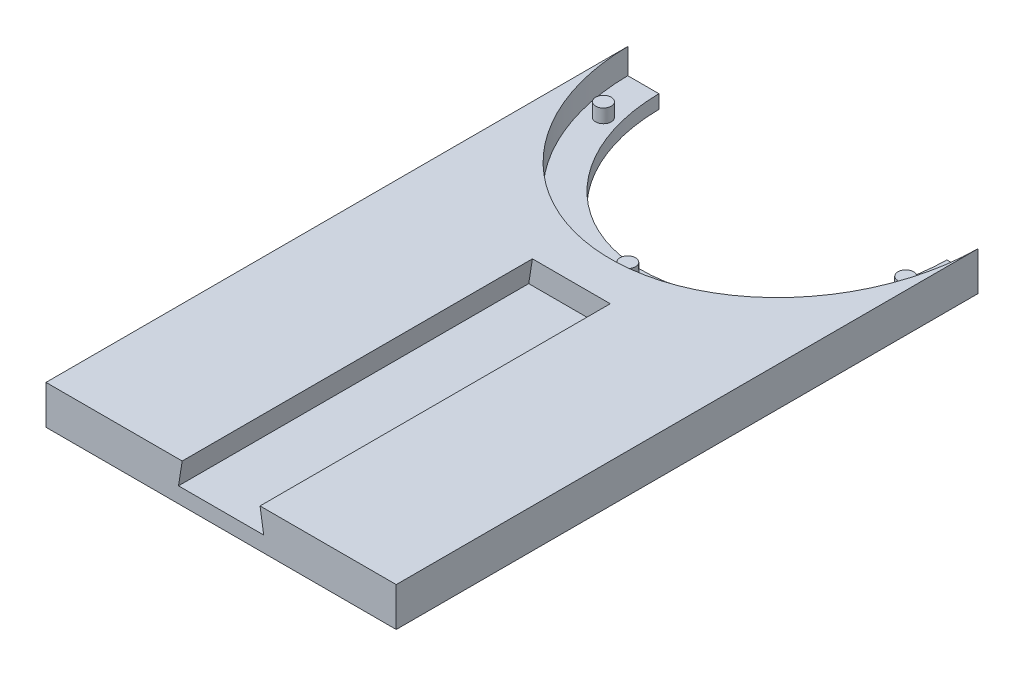
ISO-10303-21;
HEADER;
FILE_DESCRIPTION(('STEP AP214'),'2;1');
FILE_NAME('part.step','',(''),(''),'','','');
FILE_SCHEMA(('AUTOMOTIVE_DESIGN { 1 0 10303 214 1 1 1 1 }'));
ENDSEC;
DATA;
#1=APPLICATION_CONTEXT('core data for automotive mechanical design processes');
#2=APPLICATION_PROTOCOL_DEFINITION('international standard','automotive_design',2000,#1);
#3=PRODUCT_CONTEXT('',#1,'mechanical');
#4=PRODUCT('Part','Part','',(#3));
#5=PRODUCT_RELATED_PRODUCT_CATEGORY('part','',(#4));
#6=PRODUCT_DEFINITION_FORMATION('','',#4);
#7=PRODUCT_DEFINITION_CONTEXT('part definition',#1,'design');
#8=PRODUCT_DEFINITION('design','',#6,#7);
#9=PRODUCT_DEFINITION_SHAPE('','',#8);
#10=(LENGTH_UNIT() NAMED_UNIT(*) SI_UNIT(.MILLI.,.METRE.));
#11=(NAMED_UNIT(*) PLANE_ANGLE_UNIT() SI_UNIT($,.RADIAN.));
#12=(NAMED_UNIT(*) SI_UNIT($,.STERADIAN.) SOLID_ANGLE_UNIT());
#13=UNCERTAINTY_MEASURE_WITH_UNIT(LENGTH_MEASURE(1.E-05),#10,'distance_accuracy_value','');
#14=(GEOMETRIC_REPRESENTATION_CONTEXT(3) GLOBAL_UNCERTAINTY_ASSIGNED_CONTEXT((#13)) GLOBAL_UNIT_ASSIGNED_CONTEXT((#10,
#11,#12)) REPRESENTATION_CONTEXT('',''));
#15=CARTESIAN_POINT('',(0.,0.,0.));
#16=DIRECTION('',(0.,0.,1.));
#17=DIRECTION('',(1.,0.,0.));
#18=AXIS2_PLACEMENT_3D('',#15,#16,#17);
#19=CARTESIAN_POINT('',(0.,10.,0.));
#20=DIRECTION('',(0.,1.,0.));
#21=DIRECTION('',(0.,0.,1.));
#22=AXIS2_PLACEMENT_3D('',#19,#20,#21);
#23=ELLIPSE('',#22,50.,45.);
#24=DIRECTION('',(0.,-1.,0.));
#25=VECTOR('',#24,1.);
#26=SURFACE_OF_LINEAR_EXTRUSION('',#23,#25);
#27=CARTESIAN_POINT('',(0.,3.5,0.));
#28=DIRECTION('',(0.,1.,0.));
#29=DIRECTION('',(0.,0.,1.));
#30=AXIS2_PLACEMENT_3D('',#27,#28,#29);
#31=ELLIPSE('',#30,50.,45.);
#32=CARTESIAN_POINT('',(-44.9977499437472,3.5,0.5));
#33=VERTEX_POINT('',#32);
#34=CARTESIAN_POINT('',(44.9977499437472,3.5,0.5));
#35=VERTEX_POINT('',#34);
#36=EDGE_CURVE('E172',#33,#35,#31,.T.);
#37=ORIENTED_EDGE('',*,*,#36,.F.);
#38=DIRECTION('',(0.,-1.,0.));
#39=VECTOR('',#38,1.);
#40=CARTESIAN_POINT('',(-44.9977499437472,10.,0.5));
#41=LINE('',#40,#39);
#42=CARTESIAN_POINT('',(-44.9977499437472,10.,0.5));
#43=VERTEX_POINT('',#42);
#44=EDGE_CURVE('E54',#43,#33,#41,.T.);
#45=ORIENTED_EDGE('',*,*,#44,.F.);
#46=CARTESIAN_POINT('',(44.9977499437472,10.,0.5));
#47=VERTEX_POINT('',#46);
#48=EDGE_CURVE('E266',#43,#47,#23,.T.);
#49=ORIENTED_EDGE('',*,*,#48,.T.);
#50=DIRECTION('',(0.,-1.,0.));
#51=VECTOR('',#50,1.);
#52=CARTESIAN_POINT('',(44.9977499437472,10.,0.5));
#53=LINE('',#52,#51);
#54=EDGE_CURVE('E70',#47,#35,#53,.T.);
#55=ORIENTED_EDGE('',*,*,#54,.T.);
#56=EDGE_LOOP('',(#37,#45,#49,#55));
#57=FACE_BOUND('',#56,.T.);
#58=ADVANCED_FACE('F45',(#57),#26,.T.);
#59=CARTESIAN_POINT('',(0.,10.,0.5));
#60=DIRECTION('',(0.,0.,-1.));
#61=DIRECTION('',(-1.,0.,0.));
#62=AXIS2_PLACEMENT_3D('',#59,#60,#61);
#63=PLANE('',#62);
#64=DIRECTION('',(1.,0.,0.));
#65=VECTOR('',#64,1.);
#66=CARTESIAN_POINT('',(0.,0.,0.5));
#67=LINE('',#66,#65);
#68=CARTESIAN_POINT('',(-45.,0.,0.5));
#69=VERTEX_POINT('',#68);
#70=CARTESIAN_POINT('',(-36.9973577680352,0.,0.5));
#71=VERTEX_POINT('',#70);
#72=EDGE_CURVE('E150',#69,#71,#67,.T.);
#73=ORIENTED_EDGE('',*,*,#72,.F.);
#74=DIRECTION('',(0.,-1.,0.));
#75=VECTOR('',#74,1.);
#76=CARTESIAN_POINT('',(-45.,10.,0.5));
#77=LINE('',#76,#75);
#78=CARTESIAN_POINT('',(-45.,10.,0.5));
#79=VERTEX_POINT('',#78);
#80=EDGE_CURVE('E249',#79,#69,#77,.T.);
#81=ORIENTED_EDGE('',*,*,#80,.F.);
#82=DIRECTION('',(1.,0.,0.));
#83=VECTOR('',#82,1.);
#84=CARTESIAN_POINT('',(0.,10.,0.5));
#85=LINE('',#84,#83);
#86=EDGE_CURVE('E146',#79,#43,#85,.T.);
#87=ORIENTED_EDGE('',*,*,#86,.T.);
#88=ORIENTED_EDGE('',*,*,#44,.T.);
#89=DIRECTION('',(1.,0.,0.));
#90=VECTOR('',#89,1.);
#91=CARTESIAN_POINT('',(0.,3.5,0.5));
#92=LINE('',#91,#90);
#93=CARTESIAN_POINT('',(-36.9973577680352,3.5,0.5));
#94=VERTEX_POINT('',#93);
#95=EDGE_CURVE('E177',#33,#94,#92,.T.);
#96=ORIENTED_EDGE('',*,*,#95,.T.);
#97=DIRECTION('',(0.,-1.,0.));
#98=VECTOR('',#97,1.);
#99=CARTESIAN_POINT('',(-36.9973577680352,3.5,0.5));
#100=LINE('',#99,#98);
#101=EDGE_CURVE('E176',#94,#71,#100,.T.);
#102=ORIENTED_EDGE('',*,*,#101,.T.);
#103=EDGE_LOOP('',(#73,#81,#87,#88,#96,#102));
#104=FACE_BOUND('',#103,.T.);
#105=ADVANCED_FACE('F223',(#104),#63,.T.);
#106=CARTESIAN_POINT('',(-45.,10.,0.));
#107=DIRECTION('',(-1.,0.,0.));
#108=DIRECTION('',(0.,0.,1.));
#109=AXIS2_PLACEMENT_3D('',#106,#107,#108);
#110=PLANE('',#109);
#111=DIRECTION('',(0.,0.,-1.));
#112=VECTOR('',#111,1.);
#113=CARTESIAN_POINT('',(-45.,0.,0.));
#114=LINE('',#113,#112);
#115=CARTESIAN_POINT('',(-45.,0.,150.));
#116=VERTEX_POINT('',#115);
#117=EDGE_CURVE('E154',#116,#69,#114,.T.);
#118=ORIENTED_EDGE('',*,*,#117,.F.);
#119=DIRECTION('',(0.,-1.,0.));
#120=VECTOR('',#119,1.);
#121=CARTESIAN_POINT('',(-45.,10.,150.));
#122=LINE('',#121,#120);
#123=CARTESIAN_POINT('',(-45.,10.,150.));
#124=VERTEX_POINT('',#123);
#125=EDGE_CURVE('E137',#124,#116,#122,.T.);
#126=ORIENTED_EDGE('',*,*,#125,.F.);
#127=DIRECTION('',(0.,0.,-1.));
#128=VECTOR('',#127,1.);
#129=CARTESIAN_POINT('',(-45.,10.,0.));
#130=LINE('',#129,#128);
#131=EDGE_CURVE('E126',#124,#79,#130,.T.);
#132=ORIENTED_EDGE('',*,*,#131,.T.);
#133=ORIENTED_EDGE('',*,*,#80,.T.);
#134=EDGE_LOOP('',(#118,#126,#132,#133));
#135=FACE_BOUND('',#134,.T.);
#136=ADVANCED_FACE('F227',(#135),#110,.T.);
#137=CARTESIAN_POINT('',(0.,10.,150.));
#138=DIRECTION('',(0.,0.,-1.));
#139=DIRECTION('',(-1.,0.,0.));
#140=AXIS2_PLACEMENT_3D('',#137,#138,#139);
#141=PLANE('',#140);
#142=DIRECTION('',(1.,0.,0.));
#143=VECTOR('',#142,1.);
#144=CARTESIAN_POINT('',(-10.9503066419472,4.,150.));
#145=LINE('',#144,#143);
#146=CARTESIAN_POINT('',(-10.9503066419472,4.,150.));
#147=VERTEX_POINT('',#146);
#148=CARTESIAN_POINT('',(10.9503066419472,4.00000000000005,150.));
#149=VERTEX_POINT('',#148);
#150=EDGE_CURVE('E312',#147,#149,#145,.T.);
#151=ORIENTED_EDGE('',*,*,#150,.F.);
#152=DIRECTION('',(-0.156434465040235,-0.987688340595137,0.));
#153=VECTOR('',#152,1.);
#154=CARTESIAN_POINT('',(-10.,10.,150.));
#155=LINE('',#154,#153);
#156=CARTESIAN_POINT('',(-10.,10.,150.));
#157=VERTEX_POINT('',#156);
#158=EDGE_CURVE('E315',#157,#147,#155,.T.);
#159=ORIENTED_EDGE('',*,*,#158,.F.);
#160=DIRECTION('',(1.,0.,0.));
#161=VECTOR('',#160,1.);
#162=CARTESIAN_POINT('',(0.,10.,150.));
#163=LINE('',#162,#161);
#164=EDGE_CURVE('E125',#124,#157,#163,.T.);
#165=ORIENTED_EDGE('',*,*,#164,.F.);
#166=ORIENTED_EDGE('',*,*,#125,.T.);
#167=DIRECTION('',(1.,0.,0.));
#168=VECTOR('',#167,1.);
#169=CARTESIAN_POINT('',(0.,0.,150.));
#170=LINE('',#169,#168);
#171=CARTESIAN_POINT('',(45.,0.,150.));
#172=VERTEX_POINT('',#171);
#173=EDGE_CURVE('E133',#116,#172,#170,.T.);
#174=ORIENTED_EDGE('',*,*,#173,.T.);
#175=DIRECTION('',(0.,-1.,0.));
#176=VECTOR('',#175,1.);
#177=CARTESIAN_POINT('',(45.,10.,150.));
#178=LINE('',#177,#176);
#179=CARTESIAN_POINT('',(45.,10.,150.));
#180=VERTEX_POINT('',#179);
#181=EDGE_CURVE('E129',#180,#172,#178,.T.);
#182=ORIENTED_EDGE('',*,*,#181,.F.);
#183=CARTESIAN_POINT('',(9.99999999999997,10.,150.));
#184=VERTEX_POINT('',#183);
#185=EDGE_CURVE('E112',#184,#180,#163,.T.);
#186=ORIENTED_EDGE('',*,*,#185,.F.);
#187=DIRECTION('',(0.156434465040239,-0.987688340595136,0.));
#188=VECTOR('',#187,1.);
#189=CARTESIAN_POINT('',(9.99999999999997,10.,150.));
#190=LINE('',#189,#188);
#191=EDGE_CURVE('E306',#184,#149,#190,.T.);
#192=ORIENTED_EDGE('',*,*,#191,.T.);
#193=EDGE_LOOP('',(#151,#159,#165,#166,#174,#182,#186,#192));
#194=FACE_BOUND('',#193,.T.);
#195=ADVANCED_FACE('F131',(#194),#141,.F.);
#196=CARTESIAN_POINT('',(45.,10.,0.));
#197=DIRECTION('',(-1.,0.,0.));
#198=DIRECTION('',(0.,0.,1.));
#199=AXIS2_PLACEMENT_3D('',#196,#197,#198);
#200=PLANE('',#199);
#201=DIRECTION('',(0.,0.,-1.));
#202=VECTOR('',#201,1.);
#203=CARTESIAN_POINT('',(45.,0.,0.));
#204=LINE('',#203,#202);
#205=CARTESIAN_POINT('',(45.,0.,0.5));
#206=VERTEX_POINT('',#205);
#207=EDGE_CURVE('E162',#172,#206,#204,.T.);
#208=ORIENTED_EDGE('',*,*,#207,.T.);
#209=DIRECTION('',(0.,-1.,0.));
#210=VECTOR('',#209,1.);
#211=CARTESIAN_POINT('',(45.,10.,0.5));
#212=LINE('',#211,#210);
#213=CARTESIAN_POINT('',(45.,10.,0.5));
#214=VERTEX_POINT('',#213);
#215=EDGE_CURVE('E91',#214,#206,#212,.T.);
#216=ORIENTED_EDGE('',*,*,#215,.F.);
#217=DIRECTION('',(0.,0.,-1.));
#218=VECTOR('',#217,1.);
#219=CARTESIAN_POINT('',(45.,10.,0.));
#220=LINE('',#219,#218);
#221=EDGE_CURVE('E118',#180,#214,#220,.T.);
#222=ORIENTED_EDGE('',*,*,#221,.F.);
#223=ORIENTED_EDGE('',*,*,#181,.T.);
#224=EDGE_LOOP('',(#208,#216,#222,#223));
#225=FACE_BOUND('',#224,.T.);
#226=ADVANCED_FACE('F139',(#225),#200,.F.);
#227=CARTESIAN_POINT('',(36.9973577680352,0.,0.5));
#228=VERTEX_POINT('',#227);
#229=EDGE_CURVE('E156',#228,#206,#67,.T.);
#230=ORIENTED_EDGE('',*,*,#229,.F.);
#231=DIRECTION('',(0.,-1.,0.));
#232=VECTOR('',#231,1.);
#233=CARTESIAN_POINT('',(36.9973577680352,3.5,0.5));
#234=LINE('',#233,#232);
#235=CARTESIAN_POINT('',(36.9973577680352,3.5,0.5));
#236=VERTEX_POINT('',#235);
#237=EDGE_CURVE('E155',#236,#228,#234,.T.);
#238=ORIENTED_EDGE('',*,*,#237,.F.);
#239=EDGE_CURVE('E185',#236,#35,#92,.T.);
#240=ORIENTED_EDGE('',*,*,#239,.T.);
#241=ORIENTED_EDGE('',*,*,#54,.F.);
#242=EDGE_CURVE('E141',#47,#214,#85,.T.);
#243=ORIENTED_EDGE('',*,*,#242,.T.);
#244=ORIENTED_EDGE('',*,*,#215,.T.);
#245=EDGE_LOOP('',(#230,#238,#240,#241,#243,#244));
#246=FACE_BOUND('',#245,.T.);
#247=ADVANCED_FACE('F217',(#246),#63,.T.);
#248=CARTESIAN_POINT('',(0.,10.,0.));
#249=DIRECTION('',(0.,1.,0.));
#250=DIRECTION('',(0.,0.,1.));
#251=AXIS2_PLACEMENT_3D('',#248,#249,#250);
#252=PLANE('',#251);
#253=DIRECTION('',(0.,0.,1.));
#254=VECTOR('',#253,1.);
#255=CARTESIAN_POINT('',(-10.,10.,60.));
#256=LINE('',#255,#254);
#257=CARTESIAN_POINT('',(-10.,10.,60.));
#258=VERTEX_POINT('',#257);
#259=EDGE_CURVE('E275',#258,#157,#256,.T.);
#260=ORIENTED_EDGE('',*,*,#259,.F.);
#261=DIRECTION('',(-1.,0.,0.));
#262=VECTOR('',#261,1.);
#263=CARTESIAN_POINT('',(9.99999999999997,10.,60.));
#264=LINE('',#263,#262);
#265=CARTESIAN_POINT('',(9.99999999999997,10.,60.));
#266=VERTEX_POINT('',#265);
#267=EDGE_CURVE('E331',#266,#258,#264,.T.);
#268=ORIENTED_EDGE('',*,*,#267,.F.);
#269=DIRECTION('',(0.,0.,1.));
#270=VECTOR('',#269,1.);
#271=CARTESIAN_POINT('',(9.99999999999997,10.,60.));
#272=LINE('',#271,#270);
#273=EDGE_CURVE('E121',#266,#184,#272,.T.);
#274=ORIENTED_EDGE('',*,*,#273,.T.);
#275=ORIENTED_EDGE('',*,*,#185,.T.);
#276=ORIENTED_EDGE('',*,*,#221,.T.);
#277=ORIENTED_EDGE('',*,*,#242,.F.);
#278=ORIENTED_EDGE('',*,*,#48,.F.);
#279=ORIENTED_EDGE('',*,*,#86,.F.);
#280=ORIENTED_EDGE('',*,*,#131,.F.);
#281=ORIENTED_EDGE('',*,*,#164,.T.);
#282=EDGE_LOOP('',(#260,#268,#274,#275,#276,#277,#278,#279,#280,#281));
#283=FACE_BOUND('',#282,.T.);
#284=ADVANCED_FACE('F115',(#283),#252,.T.);
#285=CARTESIAN_POINT('',(0.,0.,0.));
#286=DIRECTION('',(0.,1.,0.));
#287=DIRECTION('',(0.,0.,1.));
#288=AXIS2_PLACEMENT_3D('',#285,#286,#287);
#289=PLANE('',#288);
#290=ORIENTED_EDGE('',*,*,#72,.T.);
#291=CARTESIAN_POINT('',(0.,0.,-42.));
#292=CARTESIAN_POINT('',(-4.93138164351082,0.,-42.));
#293=CARTESIAN_POINT('',(-14.7941449305325,0.,-39.7237391442364));
#294=CARTESIAN_POINT('',(-27.0896008441229,0.,-30.2004855000218));
#295=CARTESIAN_POINT('',(-35.1368792596779,0.,-16.2564691599312));
#296=CARTESIAN_POINT('',(-37.931560370161,0.,0.));
#297=CARTESIAN_POINT('',(-35.1368792596779,0.,16.2564691599312));
#298=CARTESIAN_POINT('',(-27.0896008441229,0.,30.2004855000218));
#299=CARTESIAN_POINT('',(-14.7941449305325,0.,39.7237391442364));
#300=CARTESIAN_POINT('',(0.,0.,43.1381304278818));
#301=CARTESIAN_POINT('',(14.7941449305325,0.,39.7237391442364));
#302=CARTESIAN_POINT('',(27.0896008441229,0.,30.2004855000219));
#303=CARTESIAN_POINT('',(35.1368792596779,0.,16.2564691599312));
#304=CARTESIAN_POINT('',(37.931560370161,0.,0.));
#305=CARTESIAN_POINT('',(35.1368792596779,0.,-16.2564691599312));
#306=CARTESIAN_POINT('',(27.0896008441229,0.,-30.2004855000218));
#307=CARTESIAN_POINT('',(14.7941449305325,0.,-39.7237391442364));
#308=CARTESIAN_POINT('',(4.93138164351083,0.,-42.));
#309=CARTESIAN_POINT('',(0.,0.,-42.));
#310=B_SPLINE_CURVE_WITH_KNOTS('',3,(#291,#292,#293,#294,#295,#296,#297,#298,#299,#300,#301,
#302,#303,#304,#305,#306,#307,#308,#309),.UNSPECIFIED.,.T.,.F.,(4,1,1,1,1,1,1,1,1,1,1,1,1,1,1,1,
4),(0.,0.392699081698724,0.785398163397448,1.17809724509617,1.5707963267949,1.96349540849362,
2.35619449019234,2.74889357189107,3.14159265358979,3.53429173528852,3.92699081698724,
4.31968989868597,4.71238898038469,5.10508806208341,5.49778714378214,5.89048622548086,
6.28318530717959),.UNSPECIFIED.);
#311=EDGE_CURVE('E199',#71,#228,#310,.T.);
#312=ORIENTED_EDGE('',*,*,#311,.T.);
#313=ORIENTED_EDGE('',*,*,#229,.T.);
#314=ORIENTED_EDGE('',*,*,#207,.F.);
#315=ORIENTED_EDGE('',*,*,#173,.F.);
#316=ORIENTED_EDGE('',*,*,#117,.T.);
#317=EDGE_LOOP('',(#290,#312,#313,#314,#315,#316));
#318=FACE_BOUND('',#317,.T.);
#319=ADVANCED_FACE('F212',(#318),#289,.F.);
#320=CARTESIAN_POINT('',(0.,3.5,-42.));
#321=CARTESIAN_POINT('',(-4.93138164351082,3.5,-42.));
#322=CARTESIAN_POINT('',(-14.7941449305325,3.5,-39.7237391442364));
#323=CARTESIAN_POINT('',(-27.0896008441229,3.5,-30.2004855000218));
#324=CARTESIAN_POINT('',(-35.1368792596779,3.5,-16.2564691599312));
#325=CARTESIAN_POINT('',(-37.931560370161,3.5,0.));
#326=CARTESIAN_POINT('',(-35.1368792596779,3.5,16.2564691599312));
#327=CARTESIAN_POINT('',(-27.0896008441229,3.5,30.2004855000218));
#328=CARTESIAN_POINT('',(-14.7941449305325,3.5,39.7237391442364));
#329=CARTESIAN_POINT('',(0.,3.5,43.1381304278818));
#330=CARTESIAN_POINT('',(14.7941449305325,3.5,39.7237391442364));
#331=CARTESIAN_POINT('',(27.0896008441229,3.5,30.2004855000219));
#332=CARTESIAN_POINT('',(35.1368792596779,3.5,16.2564691599312));
#333=CARTESIAN_POINT('',(37.931560370161,3.5,0.));
#334=CARTESIAN_POINT('',(35.1368792596779,3.5,-16.2564691599312));
#335=CARTESIAN_POINT('',(27.0896008441229,3.5,-30.2004855000218));
#336=CARTESIAN_POINT('',(14.7941449305325,3.5,-39.7237391442364));
#337=CARTESIAN_POINT('',(4.93138164351083,3.5,-42.));
#338=CARTESIAN_POINT('',(0.,3.5,-42.));
#339=B_SPLINE_CURVE_WITH_KNOTS('',3,(#320,#321,#322,#323,#324,#325,#326,#327,#328,#329,#330,
#331,#332,#333,#334,#335,#336,#337,#338),.UNSPECIFIED.,.T.,.F.,(4,1,1,1,1,1,1,1,1,1,1,1,1,1,1,1,
4),(0.,0.392699081698724,0.785398163397448,1.17809724509617,1.5707963267949,1.96349540849362,
2.35619449019234,2.74889357189107,3.14159265358979,3.53429173528852,3.92699081698724,
4.31968989868597,4.71238898038469,5.10508806208341,5.49778714378214,5.89048622548086,
6.28318530717959),.UNSPECIFIED.);
#340=DIRECTION('',(0.,-1.,0.));
#341=VECTOR('',#340,1.);
#342=SURFACE_OF_LINEAR_EXTRUSION('',#339,#341);
#343=ORIENTED_EDGE('',*,*,#311,.F.);
#344=ORIENTED_EDGE('',*,*,#101,.F.);
#345=EDGE_CURVE('E184',#94,#236,#339,.T.);
#346=ORIENTED_EDGE('',*,*,#345,.T.);
#347=ORIENTED_EDGE('',*,*,#237,.T.);
#348=EDGE_LOOP('',(#343,#344,#346,#347));
#349=FACE_BOUND('',#348,.T.);
#350=ADVANCED_FACE('F207',(#349),#342,.T.);
#351=CARTESIAN_POINT('',(0.,3.5,0.));
#352=DIRECTION('',(0.,1.,0.));
#353=DIRECTION('',(0.,0.,1.));
#354=AXIS2_PLACEMENT_3D('',#351,#352,#353);
#355=PLANE('',#354);
#356=CARTESIAN_POINT('',(38.8404838015386,3.5,12.9089643673815));
#357=DIRECTION('',(0.,1.,0.));
#358=DIRECTION('',(0.,0.,1.));
#359=AXIS2_PLACEMENT_3D('',#356,#357,#358);
#360=CIRCLE('',#359,2.);
#361=CARTESIAN_POINT('',(38.8404838015386,3.5,14.9089643673815));
#362=VERTEX_POINT('',#361);
#363=EDGE_CURVE('E11',#362,#362,#360,.T.);
#364=ORIENTED_EDGE('',*,*,#363,.F.);
#365=EDGE_LOOP('',(#364));
#366=FACE_BOUND('',#365,.T.);
#367=CARTESIAN_POINT('',(0.,3.5,45.5));
#368=DIRECTION('',(0.,1.,0.));
#369=DIRECTION('',(0.,0.,1.));
#370=AXIS2_PLACEMENT_3D('',#367,#368,#369);
#371=CIRCLE('',#370,2.);
#372=CARTESIAN_POINT('',(0.,3.5,47.5));
#373=VERTEX_POINT('',#372);
#374=EDGE_CURVE('E337',#373,#373,#371,.F.);
#375=ORIENTED_EDGE('',*,*,#374,.T.);
#376=EDGE_LOOP('',(#375));
#377=FACE_BOUND('',#376,.T.);
#378=CARTESIAN_POINT('',(-38.8404838015386,3.5,12.9089643673815));
#379=DIRECTION('',(0.,1.,0.));
#380=DIRECTION('',(0.,0.,1.));
#381=AXIS2_PLACEMENT_3D('',#378,#379,#380);
#382=CIRCLE('',#381,2.);
#383=CARTESIAN_POINT('',(-38.8404838015386,3.5,14.9089643673815));
#384=VERTEX_POINT('',#383);
#385=EDGE_CURVE('E346',#384,#384,#382,.F.);
#386=ORIENTED_EDGE('',*,*,#385,.T.);
#387=EDGE_LOOP('',(#386));
#388=FACE_BOUND('',#387,.T.);
#389=ORIENTED_EDGE('',*,*,#239,.F.);
#390=ORIENTED_EDGE('',*,*,#345,.F.);
#391=ORIENTED_EDGE('',*,*,#95,.F.);
#392=ORIENTED_EDGE('',*,*,#36,.T.);
#393=EDGE_LOOP('',(#389,#390,#391,#392));
#394=FACE_BOUND('',#393,.T.);
#395=ADVANCED_FACE('F211',(#366,#377,#388,#394),#355,.T.);
#396=CARTESIAN_POINT('',(-38.8404838015386,7.,12.9089643673815));
#397=DIRECTION('',(0.,-1.,0.));
#398=DIRECTION('',(0.,0.,-1.));
#399=AXIS2_PLACEMENT_3D('',#396,#397,#398);
#400=CYLINDRICAL_SURFACE('',#399,2.);
#401=ORIENTED_EDGE('',*,*,#385,.F.);
#402=EDGE_LOOP('',(#401));
#403=FACE_BOUND('',#402,.T.);
#404=CARTESIAN_POINT('',(-38.8404838015386,7.,12.9089643673815));
#405=DIRECTION('',(0.,1.,0.));
#406=DIRECTION('',(0.,0.,1.));
#407=AXIS2_PLACEMENT_3D('',#404,#405,#406);
#408=CIRCLE('',#407,2.);
#409=CARTESIAN_POINT('',(-38.8404838015386,7.,14.9089643673815));
#410=VERTEX_POINT('',#409);
#411=EDGE_CURVE('E190',#410,#410,#408,.T.);
#412=ORIENTED_EDGE('',*,*,#411,.F.);
#413=EDGE_LOOP('',(#412));
#414=FACE_BOUND('',#413,.T.);
#415=ADVANCED_FACE('F357',(#403,#414),#400,.T.);
#416=CARTESIAN_POINT('',(-38.8404838015386,7.,12.9089643673815));
#417=DIRECTION('',(0.,1.,0.));
#418=DIRECTION('',(0.,0.,1.));
#419=AXIS2_PLACEMENT_3D('',#416,#417,#418);
#420=PLANE('',#419);
#421=ORIENTED_EDGE('',*,*,#411,.T.);
#422=EDGE_LOOP('',(#421));
#423=FACE_BOUND('',#422,.T.);
#424=ADVANCED_FACE('F362',(#423),#420,.T.);
#425=CARTESIAN_POINT('',(0.,7.,45.5));
#426=DIRECTION('',(0.,-1.,0.));
#427=DIRECTION('',(0.,0.,-1.));
#428=AXIS2_PLACEMENT_3D('',#425,#426,#427);
#429=CYLINDRICAL_SURFACE('',#428,2.);
#430=ORIENTED_EDGE('',*,*,#374,.F.);
#431=EDGE_LOOP('',(#430));
#432=FACE_BOUND('',#431,.T.);
#433=CARTESIAN_POINT('',(0.,7.,45.5));
#434=DIRECTION('',(0.,1.,0.));
#435=DIRECTION('',(0.,0.,1.));
#436=AXIS2_PLACEMENT_3D('',#433,#434,#435);
#437=CIRCLE('',#436,2.);
#438=CARTESIAN_POINT('',(0.,7.,47.5));
#439=VERTEX_POINT('',#438);
#440=EDGE_CURVE('E334',#439,#439,#437,.T.);
#441=ORIENTED_EDGE('',*,*,#440,.F.);
#442=EDGE_LOOP('',(#441));
#443=FACE_BOUND('',#442,.T.);
#444=ADVANCED_FACE('F382',(#432,#443),#429,.T.);
#445=CARTESIAN_POINT('',(0.,7.,45.5));
#446=DIRECTION('',(0.,1.,0.));
#447=DIRECTION('',(0.,0.,1.));
#448=AXIS2_PLACEMENT_3D('',#445,#446,#447);
#449=PLANE('',#448);
#450=ORIENTED_EDGE('',*,*,#440,.T.);
#451=EDGE_LOOP('',(#450));
#452=FACE_BOUND('',#451,.T.);
#453=ADVANCED_FACE('F370',(#452),#449,.T.);
#454=CARTESIAN_POINT('',(38.8404838015386,7.,12.9089643673815));
#455=DIRECTION('',(0.,-1.,0.));
#456=DIRECTION('',(0.,0.,-1.));
#457=AXIS2_PLACEMENT_3D('',#454,#455,#456);
#458=CYLINDRICAL_SURFACE('',#457,2.);
#459=ORIENTED_EDGE('',*,*,#363,.T.);
#460=EDGE_LOOP('',(#459));
#461=FACE_BOUND('',#460,.T.);
#462=CARTESIAN_POINT('',(38.8404838015386,7.,12.9089643673815));
#463=DIRECTION('',(0.,-1.,0.));
#464=DIRECTION('',(0.,0.,-1.));
#465=AXIS2_PLACEMENT_3D('',#462,#463,#464);
#466=CIRCLE('',#465,2.);
#467=CARTESIAN_POINT('',(38.8404838015386,7.,10.9089643673815));
#468=VERTEX_POINT('',#467);
#469=EDGE_CURVE('E326',#468,#468,#466,.T.);
#470=ORIENTED_EDGE('',*,*,#469,.T.);
#471=EDGE_LOOP('',(#470));
#472=FACE_BOUND('',#471,.T.);
#473=ADVANCED_FACE('F366',(#461,#472),#458,.T.);
#474=CARTESIAN_POINT('',(38.8404838015386,7.,12.9089643673815));
#475=DIRECTION('',(0.,-1.,0.));
#476=DIRECTION('',(0.,0.,-1.));
#477=AXIS2_PLACEMENT_3D('',#474,#475,#476);
#478=PLANE('',#477);
#479=ORIENTED_EDGE('',*,*,#469,.F.);
#480=EDGE_LOOP('',(#479));
#481=FACE_BOUND('',#480,.T.);
#482=ADVANCED_FACE('F369',(#481),#478,.F.);
#483=CARTESIAN_POINT('',(-10.,10.,60.));
#484=DIRECTION('',(-0.987688340595137,0.156434465040235,0.));
#485=DIRECTION('',(-0.156434465040235,-0.987688340595137,0.));
#486=AXIS2_PLACEMENT_3D('',#483,#484,#485);
#487=PLANE('',#486);
#488=ORIENTED_EDGE('',*,*,#158,.T.);
#489=DIRECTION('',(0.,0.,1.));
#490=VECTOR('',#489,1.);
#491=CARTESIAN_POINT('',(-10.9503066419472,4.,60.));
#492=LINE('',#491,#490);
#493=CARTESIAN_POINT('',(-10.9503066419472,4.,60.));
#494=VERTEX_POINT('',#493);
#495=EDGE_CURVE('E310',#494,#147,#492,.T.);
#496=ORIENTED_EDGE('',*,*,#495,.F.);
#497=DIRECTION('',(-0.156434465040235,-0.987688340595137,0.));
#498=VECTOR('',#497,1.);
#499=CARTESIAN_POINT('',(-10.,10.,60.));
#500=LINE('',#499,#498);
#501=EDGE_CURVE('E295',#258,#494,#500,.T.);
#502=ORIENTED_EDGE('',*,*,#501,.F.);
#503=ORIENTED_EDGE('',*,*,#259,.T.);
#504=EDGE_LOOP('',(#488,#496,#502,#503));
#505=FACE_BOUND('',#504,.T.);
#506=ADVANCED_FACE('F375',(#505),#487,.F.);
#507=CARTESIAN_POINT('',(9.99999999999997,10.,60.));
#508=DIRECTION('',(-0.987688340595136,-0.156434465040239,0.));
#509=DIRECTION('',(0.156434465040239,-0.987688340595137,0.));
#510=AXIS2_PLACEMENT_3D('',#507,#508,#509);
#511=PLANE('',#510);
#512=ORIENTED_EDGE('',*,*,#191,.F.);
#513=ORIENTED_EDGE('',*,*,#273,.F.);
#514=DIRECTION('',(0.156434465040239,-0.987688340595136,0.));
#515=VECTOR('',#514,1.);
#516=CARTESIAN_POINT('',(9.99999999999997,10.,60.));
#517=LINE('',#516,#515);
#518=CARTESIAN_POINT('',(10.9503066419472,4.00000000000005,60.));
#519=VERTEX_POINT('',#518);
#520=EDGE_CURVE('E61',#266,#519,#517,.T.);
#521=ORIENTED_EDGE('',*,*,#520,.T.);
#522=DIRECTION('',(0.,0.,1.));
#523=VECTOR('',#522,1.);
#524=CARTESIAN_POINT('',(10.9503066419472,4.00000000000005,60.));
#525=LINE('',#524,#523);
#526=EDGE_CURVE('E303',#519,#149,#525,.T.);
#527=ORIENTED_EDGE('',*,*,#526,.T.);
#528=EDGE_LOOP('',(#512,#513,#521,#527));
#529=FACE_BOUND('',#528,.T.);
#530=ADVANCED_FACE('F305',(#529),#511,.T.);
#531=CARTESIAN_POINT('',(-10.9503066419472,4.,60.));
#532=DIRECTION('',(0.,-1.,0.));
#533=DIRECTION('',(1.,0.,0.));
#534=AXIS2_PLACEMENT_3D('',#531,#532,#533);
#535=PLANE('',#534);
#536=ORIENTED_EDGE('',*,*,#150,.T.);
#537=ORIENTED_EDGE('',*,*,#526,.F.);
#538=DIRECTION('',(1.,0.,0.));
#539=VECTOR('',#538,1.);
#540=CARTESIAN_POINT('',(-10.9503066419472,4.,60.));
#541=LINE('',#540,#539);
#542=EDGE_CURVE('E320',#494,#519,#541,.T.);
#543=ORIENTED_EDGE('',*,*,#542,.F.);
#544=ORIENTED_EDGE('',*,*,#495,.T.);
#545=EDGE_LOOP('',(#536,#537,#543,#544));
#546=FACE_BOUND('',#545,.T.);
#547=ADVANCED_FACE('F313',(#546),#535,.F.);
#548=CARTESIAN_POINT('',(0.,0.,60.));
#549=DIRECTION('',(0.,0.,1.));
#550=DIRECTION('',(1.,0.,0.));
#551=AXIS2_PLACEMENT_3D('',#548,#549,#550);
#552=PLANE('',#551);
#553=ORIENTED_EDGE('',*,*,#501,.T.);
#554=ORIENTED_EDGE('',*,*,#542,.T.);
#555=ORIENTED_EDGE('',*,*,#520,.F.);
#556=ORIENTED_EDGE('',*,*,#267,.T.);
#557=EDGE_LOOP('',(#553,#554,#555,#556));
#558=FACE_BOUND('',#557,.T.);
#559=ADVANCED_FACE('F457',(#558),#552,.T.);
#560=CLOSED_SHELL('',(#58,#105,#136,#195,#226,#247,#284,#319,#350,#395,#415,#424,#444,#453,#473,
#482,#506,#530,#547,#559));
#561=MANIFOLD_SOLID_BREP('B2',#560);
#562=ADVANCED_BREP_SHAPE_REPRESENTATION('',(#18,#561),#14);
#563=SHAPE_DEFINITION_REPRESENTATION(#9,#562);
ENDSEC;
END-ISO-10303-21;
